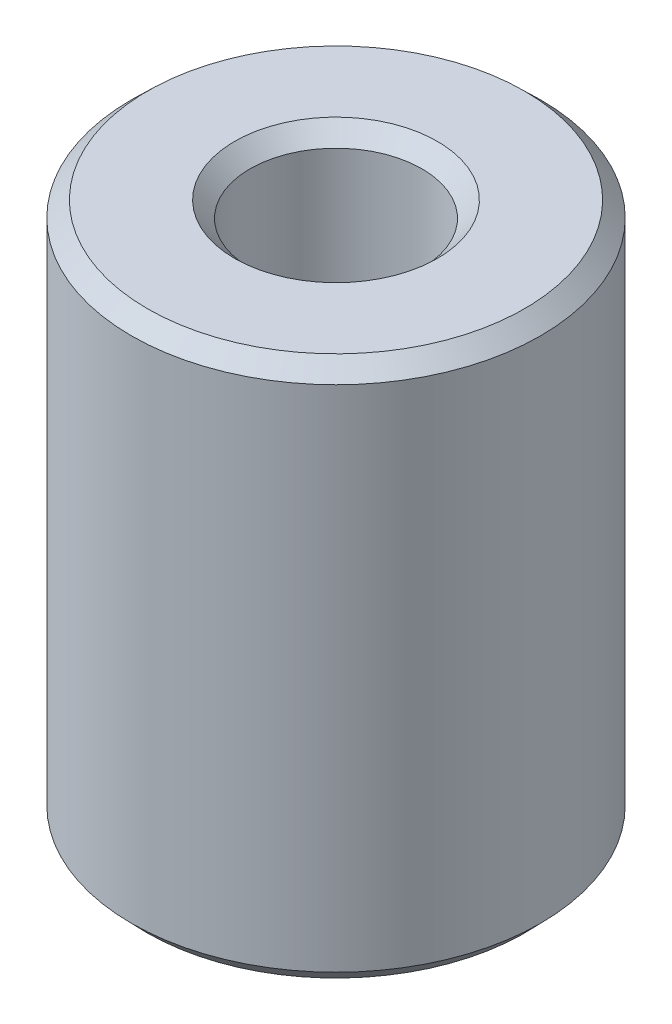
ISO-10303-21;
HEADER;
FILE_DESCRIPTION(('STEP AP214'),'2;1');
FILE_NAME('part.step','',(''),(''),'','','');
FILE_SCHEMA(('AUTOMOTIVE_DESIGN { 1 0 10303 214 1 1 1 1 }'));
ENDSEC;
DATA;
#1=APPLICATION_CONTEXT('core data for automotive mechanical design processes');
#2=APPLICATION_PROTOCOL_DEFINITION('international standard','automotive_design',2000,#1);
#3=PRODUCT_CONTEXT('',#1,'mechanical');
#4=PRODUCT('Part','Part','',(#3));
#5=PRODUCT_RELATED_PRODUCT_CATEGORY('part','',(#4));
#6=PRODUCT_DEFINITION_FORMATION('','',#4);
#7=PRODUCT_DEFINITION_CONTEXT('part definition',#1,'design');
#8=PRODUCT_DEFINITION('design','',#6,#7);
#9=PRODUCT_DEFINITION_SHAPE('','',#8);
#10=(LENGTH_UNIT() NAMED_UNIT(*) SI_UNIT(.MILLI.,.METRE.));
#11=(NAMED_UNIT(*) PLANE_ANGLE_UNIT() SI_UNIT($,.RADIAN.));
#12=(NAMED_UNIT(*) SI_UNIT($,.STERADIAN.) SOLID_ANGLE_UNIT());
#13=UNCERTAINTY_MEASURE_WITH_UNIT(LENGTH_MEASURE(1.E-05),#10,'distance_accuracy_value','');
#14=(GEOMETRIC_REPRESENTATION_CONTEXT(3) GLOBAL_UNCERTAINTY_ASSIGNED_CONTEXT((#13)) GLOBAL_UNIT_ASSIGNED_CONTEXT((#10,
#11,#12)) REPRESENTATION_CONTEXT('',''));
#15=CARTESIAN_POINT('',(0.,0.,0.));
#16=DIRECTION('',(0.,0.,1.));
#17=DIRECTION('',(1.,0.,0.));
#18=AXIS2_PLACEMENT_3D('',#15,#16,#17);
#19=CARTESIAN_POINT('',(0.,52.8330133797445,0.));
#20=DIRECTION('',(0.,-1.,0.));
#21=DIRECTION('',(0.,0.,-1.));
#22=AXIS2_PLACEMENT_3D('',#19,#20,#21);
#23=CYLINDRICAL_SURFACE('',#22,20.);
#24=CARTESIAN_POINT('',(0.,1.56288196948306,0.));
#25=DIRECTION('',(0.,1.,0.));
#26=DIRECTION('',(0.,0.,1.));
#27=AXIS2_PLACEMENT_3D('',#24,#25,#26);
#28=CIRCLE('',#27,20.);
#29=CARTESIAN_POINT('',(0.,1.56288196948305,-20.));
#30=VERTEX_POINT('',#29);
#31=EDGE_CURVE('E10',#30,#30,#28,.T.);
#32=CARTESIAN_POINT('',(0.,51.3187331504291,0.));
#33=DIRECTION('',(0.,1.,0.));
#34=DIRECTION('',(0.,0.,1.));
#35=AXIS2_PLACEMENT_3D('',#32,#33,#34);
#36=CIRCLE('',#35,20.);
#37=CARTESIAN_POINT('',(0.,51.3187331504291,-20.));
#38=VERTEX_POINT('',#37);
#39=EDGE_CURVE('E50',#38,#38,#36,.F.);
#40=CARTESIAN_POINT('',(0.,1.56288196948305,-20.));
#41=CARTESIAN_POINT('',(0.,2.08117208595124,-20.));
#42=CARTESIAN_POINT('',(0.,2.59946220241943,-20.));
#43=CARTESIAN_POINT('',(0.,3.6360424353558,-20.));
#44=CARTESIAN_POINT('',(0.,4.15433255182399,-20.));
#45=CARTESIAN_POINT('',(0.,5.19091278476037,-20.));
#46=CARTESIAN_POINT('',(0.,5.70920290122855,-20.));
#47=CARTESIAN_POINT('',(0.,6.74578313416493,-20.));
#48=CARTESIAN_POINT('',(0.,7.26407325063311,-20.));
#49=CARTESIAN_POINT('',(0.,8.30065348356949,-20.));
#50=CARTESIAN_POINT('',(0.,8.81894360003768,-20.));
#51=CARTESIAN_POINT('',(0.,9.85552383297406,-20.));
#52=CARTESIAN_POINT('',(0.,10.3738139494422,-20.));
#53=CARTESIAN_POINT('',(0.,11.4103941823786,-20.));
#54=CARTESIAN_POINT('',(0.,11.9286842988468,-20.));
#55=CARTESIAN_POINT('',(0.,12.9652645317832,-20.));
#56=CARTESIAN_POINT('',(0.,13.4835546482514,-20.));
#57=CARTESIAN_POINT('',(0.,14.5201348811877,-20.));
#58=CARTESIAN_POINT('',(0.,15.0384249976559,-20.));
#59=CARTESIAN_POINT('',(0.,16.0750052305923,-20.));
#60=CARTESIAN_POINT('',(0.,16.5932953470605,-20.));
#61=CARTESIAN_POINT('',(0.,17.6298755799969,-20.));
#62=CARTESIAN_POINT('',(0.,18.1481656964651,-20.));
#63=CARTESIAN_POINT('',(0.,19.1847459294014,-20.));
#64=CARTESIAN_POINT('',(0.,19.7030360458696,-20.));
#65=CARTESIAN_POINT('',(0.,20.739616278806,-20.));
#66=CARTESIAN_POINT('',(0.,21.2579063952742,-20.));
#67=CARTESIAN_POINT('',(0.,22.2944866282106,-20.));
#68=CARTESIAN_POINT('',(0.,22.8127767446787,-20.));
#69=CARTESIAN_POINT('',(0.,23.8493569776151,-20.));
#70=CARTESIAN_POINT('',(0.,24.3676470940833,-20.));
#71=CARTESIAN_POINT('',(0.,25.4042273270197,-20.));
#72=CARTESIAN_POINT('',(0.,25.9225174434879,-20.));
#73=CARTESIAN_POINT('',(0.,26.9590976764242,-20.));
#74=CARTESIAN_POINT('',(0.,27.4773877928924,-20.));
#75=CARTESIAN_POINT('',(0.,28.5139680258288,-20.));
#76=CARTESIAN_POINT('',(0.,29.032258142297,-20.));
#77=CARTESIAN_POINT('',(0.,30.0688383752334,-20.));
#78=CARTESIAN_POINT('',(0.,30.5871284917016,-20.));
#79=CARTESIAN_POINT('',(0.,31.6237087246379,-20.));
#80=CARTESIAN_POINT('',(0.,32.1419988411061,-20.));
#81=CARTESIAN_POINT('',(0.,33.1785790740425,-20.));
#82=CARTESIAN_POINT('',(0.,33.6968691905107,-20.));
#83=CARTESIAN_POINT('',(0.,34.7334494234471,-20.));
#84=CARTESIAN_POINT('',(0.,35.2517395399152,-20.));
#85=CARTESIAN_POINT('',(0.,36.2883197728516,-20.));
#86=CARTESIAN_POINT('',(0.,36.8066098893198,-20.));
#87=CARTESIAN_POINT('',(0.,37.8431901222562,-20.));
#88=CARTESIAN_POINT('',(0.,38.3614802387244,-20.));
#89=CARTESIAN_POINT('',(0.,39.3980604716607,-20.));
#90=CARTESIAN_POINT('',(0.,39.9163505881289,-20.));
#91=CARTESIAN_POINT('',(0.,40.9529308210653,-20.));
#92=CARTESIAN_POINT('',(0.,41.4712209375335,-20.));
#93=CARTESIAN_POINT('',(0.,42.5078011704699,-20.));
#94=CARTESIAN_POINT('',(0.,43.0260912869381,-20.));
#95=CARTESIAN_POINT('',(0.,44.0626715198744,-20.));
#96=CARTESIAN_POINT('',(0.,44.5809616363426,-20.));
#97=CARTESIAN_POINT('',(0.,45.617541869279,-20.));
#98=CARTESIAN_POINT('',(0.,46.1358319857472,-20.));
#99=CARTESIAN_POINT('',(0.,47.1724122186836,-20.));
#100=CARTESIAN_POINT('',(0.,47.6907023351517,-20.));
#101=CARTESIAN_POINT('',(0.,48.7272825680881,-20.));
#102=CARTESIAN_POINT('',(0.,49.2455726845563,-20.));
#103=CARTESIAN_POINT('',(0.,50.2821529174927,-20.));
#104=CARTESIAN_POINT('',(0.,50.8004430339609,-20.));
#105=CARTESIAN_POINT('',(0.,51.3187331504291,-20.));
#106=B_SPLINE_CURVE_WITH_KNOTS('',3,(#40,#41,#42,#43,#44,#45,#46,#47,#48,#49,#50,#51,#52,#53,
#54,#55,#56,#57,#58,#59,#60,#61,#62,#63,#64,#65,#66,#67,#68,#69,#70,#71,#72,#73,#74,#75,#76,#77,
#78,#79,#80,#81,#82,#83,#84,#85,#86,#87,#88,#89,#90,#91,#92,#93,#94,#95,#96,#97,#98,#99,#100,
#101,#102,#103,#104,#105),.UNSPECIFIED.,.F.,.F.,(4,2,2,2,2,2,2,2,2,2,2,2,2,2,2,2,2,2,2,2,2,2,2,
2,2,2,2,2,2,2,2,2,4),(0.,1.55487034940456,3.10974069880913,4.66461104821369,6.21948139761825,
7.77435174702282,9.32922209642738,10.8840924458319,12.4389627952365,13.9938331446411,
15.5487034940456,17.1035738434502,18.6584441928548,20.2133145422593,21.7681848916639,
23.3230552410684,24.877925590473,26.4327959398776,27.9876662892821,29.5425366386867,
31.0974069880913,32.6522773374958,34.2071476869004,35.7620180363049,37.3168883857095,
38.8717587351141,40.4266290845186,41.9814994339232,43.5363697833278,45.0912401327323,
46.6461104821369,48.2009808315414,49.755851180946),.UNSPECIFIED.);
#107=EDGE_CURVE('BSEAM39',#30,#38,#106,.T.);
#108=ORIENTED_EDGE('',*,*,#31,.T.);
#109=ORIENTED_EDGE('',*,*,#39,.T.);
#110=ORIENTED_EDGE('',*,*,#107,.T.);
#111=ORIENTED_EDGE('',*,*,#107,.F.);
#112=EDGE_LOOP('',(#108,#110,#109,#111));
#113=FACE_BOUND('',#112,.T.);
#114=ADVANCED_FACE('F39',(#113),#23,.T.);
#115=CARTESIAN_POINT('',(0.,52.8330133797445,0.));
#116=DIRECTION('',(0.,1.,0.));
#117=DIRECTION('',(0.,0.,1.));
#118=AXIS2_PLACEMENT_3D('',#115,#116,#117);
#119=PLANE('',#118);
#120=CARTESIAN_POINT('',(0.,52.8330133797445,0.));
#121=DIRECTION('',(0.,1.,0.));
#122=DIRECTION('',(0.,0.,1.));
#123=AXIS2_PLACEMENT_3D('',#120,#121,#122);
#124=CIRCLE('',#123,9.91834921758917);
#125=CARTESIAN_POINT('',(0.,52.8330133797445,9.91834921758917));
#126=VERTEX_POINT('',#125);
#127=EDGE_CURVE('E58',#126,#126,#124,.F.);
#128=ORIENTED_EDGE('',*,*,#127,.T.);
#129=EDGE_LOOP('',(#128));
#130=FACE_BOUND('',#129,.T.);
#131=CARTESIAN_POINT('',(0.,52.8330133797445,0.));
#132=DIRECTION('',(0.,1.,0.));
#133=DIRECTION('',(0.,0.,1.));
#134=AXIS2_PLACEMENT_3D('',#131,#132,#133);
#135=CIRCLE('',#134,18.437118030517);
#136=CARTESIAN_POINT('',(0.,52.8330133797445,18.437118030517));
#137=VERTEX_POINT('',#136);
#138=EDGE_CURVE('E61',#137,#137,#135,.T.);
#139=ORIENTED_EDGE('',*,*,#138,.T.);
#140=EDGE_LOOP('',(#139));
#141=FACE_BOUND('',#140,.T.);
#142=ADVANCED_FACE('F88',(#130,#141),#119,.T.);
#143=CARTESIAN_POINT('',(0.,0.,0.));
#144=DIRECTION('',(0.,1.,0.));
#145=DIRECTION('',(0.,0.,1.));
#146=AXIS2_PLACEMENT_3D('',#143,#144,#145);
#147=PLANE('',#146);
#148=CARTESIAN_POINT('',(0.,0.,0.));
#149=DIRECTION('',(0.,1.,0.));
#150=DIRECTION('',(0.,0.,1.));
#151=AXIS2_PLACEMENT_3D('',#148,#149,#150);
#152=CIRCLE('',#151,9.9669509577566);
#153=CARTESIAN_POINT('',(0.,0.,9.9669509577566));
#154=VERTEX_POINT('',#153);
#155=EDGE_CURVE('E51',#154,#154,#152,.T.);
#156=ORIENTED_EDGE('',*,*,#155,.T.);
#157=EDGE_LOOP('',(#156));
#158=FACE_BOUND('',#157,.T.);
#159=CARTESIAN_POINT('',(0.,0.,0.));
#160=DIRECTION('',(0.,1.,0.));
#161=DIRECTION('',(0.,0.,1.));
#162=AXIS2_PLACEMENT_3D('',#159,#160,#161);
#163=CIRCLE('',#162,18.4857197706844);
#164=CARTESIAN_POINT('',(0.,0.,18.4857197706844));
#165=VERTEX_POINT('',#164);
#166=EDGE_CURVE('E54',#165,#165,#163,.F.);
#167=ORIENTED_EDGE('',*,*,#166,.T.);
#168=EDGE_LOOP('',(#167));
#169=FACE_BOUND('',#168,.T.);
#170=ADVANCED_FACE('F83',(#158,#169),#147,.F.);
#171=CARTESIAN_POINT('',(0.,52.8330133797445,0.));
#172=DIRECTION('',(0.,-1.,0.));
#173=DIRECTION('',(0.,0.,-1.));
#174=AXIS2_PLACEMENT_3D('',#171,#172,#173);
#175=CYLINDRICAL_SURFACE('',#174,8.40406898827362);
#176=CARTESIAN_POINT('',(0.,51.2701314102615,0.));
#177=DIRECTION('',(0.,1.,0.));
#178=DIRECTION('',(0.,0.,1.));
#179=AXIS2_PLACEMENT_3D('',#176,#177,#178);
#180=CIRCLE('',#179,8.40406898827362);
#181=CARTESIAN_POINT('',(0.,51.2701314102615,-8.40406898827362));
#182=VERTEX_POINT('',#181);
#183=EDGE_CURVE('E67',#182,#182,#180,.T.);
#184=CARTESIAN_POINT('',(0.,1.51428022931549,0.));
#185=DIRECTION('',(0.,1.,0.));
#186=DIRECTION('',(0.,0.,1.));
#187=AXIS2_PLACEMENT_3D('',#184,#185,#186);
#188=CIRCLE('',#187,8.40406898827362);
#189=CARTESIAN_POINT('',(0.,1.51428022931549,-8.40406898827362));
#190=VERTEX_POINT('',#189);
#191=EDGE_CURVE('E69',#190,#190,#188,.F.);
#192=CARTESIAN_POINT('',(0.,51.2701314102615,-8.40406898827362));
#193=CARTESIAN_POINT('',(0.,50.7518412937933,-8.40406898827362));
#194=CARTESIAN_POINT('',(0.,50.2335511773251,-8.40406898827362));
#195=CARTESIAN_POINT('',(0.,49.1969709443887,-8.40406898827362));
#196=CARTESIAN_POINT('',(0.,48.6786808279205,-8.40406898827362));
#197=CARTESIAN_POINT('',(0.,47.6421005949842,-8.40406898827362));
#198=CARTESIAN_POINT('',(0.,47.123810478516,-8.40406898827362));
#199=CARTESIAN_POINT('',(0.,46.0872302455796,-8.40406898827362));
#200=CARTESIAN_POINT('',(0.,45.5689401291114,-8.40406898827362));
#201=CARTESIAN_POINT('',(0.,44.532359896175,-8.40406898827362));
#202=CARTESIAN_POINT('',(0.,44.0140697797069,-8.40406898827362));
#203=CARTESIAN_POINT('',(0.,42.9774895467705,-8.40406898827362));
#204=CARTESIAN_POINT('',(0.,42.4591994303023,-8.40406898827362));
#205=CARTESIAN_POINT('',(0.,41.4226191973659,-8.40406898827362));
#206=CARTESIAN_POINT('',(0.,40.9043290808977,-8.40406898827362));
#207=CARTESIAN_POINT('',(0.,39.8677488479614,-8.40406898827362));
#208=CARTESIAN_POINT('',(0.,39.3494587314932,-8.40406898827362));
#209=CARTESIAN_POINT('',(0.,38.3128784985568,-8.40406898827362));
#210=CARTESIAN_POINT('',(0.,37.7945883820886,-8.40406898827362));
#211=CARTESIAN_POINT('',(0.,36.7580081491522,-8.40406898827362));
#212=CARTESIAN_POINT('',(0.,36.239718032684,-8.40406898827362));
#213=CARTESIAN_POINT('',(0.,35.2031377997477,-8.40406898827362));
#214=CARTESIAN_POINT('',(0.,34.6848476832795,-8.40406898827362));
#215=CARTESIAN_POINT('',(0.,33.6482674503431,-8.40406898827362));
#216=CARTESIAN_POINT('',(0.,33.1299773338749,-8.40406898827362));
#217=CARTESIAN_POINT('',(0.,32.0933971009385,-8.40406898827362));
#218=CARTESIAN_POINT('',(0.,31.5751069844704,-8.40406898827362));
#219=CARTESIAN_POINT('',(0.,30.538526751534,-8.40406898827362));
#220=CARTESIAN_POINT('',(0.,30.0202366350658,-8.40406898827362));
#221=CARTESIAN_POINT('',(0.,28.9836564021294,-8.40406898827362));
#222=CARTESIAN_POINT('',(0.,28.4653662856612,-8.40406898827362));
#223=CARTESIAN_POINT('',(0.,27.4287860527249,-8.40406898827362));
#224=CARTESIAN_POINT('',(0.,26.9104959362567,-8.40406898827362));
#225=CARTESIAN_POINT('',(0.,25.8739157033203,-8.40406898827362));
#226=CARTESIAN_POINT('',(0.,25.3556255868521,-8.40406898827362));
#227=CARTESIAN_POINT('',(0.,24.3190453539157,-8.40406898827362));
#228=CARTESIAN_POINT('',(0.,23.8007552374475,-8.40406898827362));
#229=CARTESIAN_POINT('',(0.,22.7641750045112,-8.40406898827362));
#230=CARTESIAN_POINT('',(0.,22.245884888043,-8.40406898827362));
#231=CARTESIAN_POINT('',(0.,21.2093046551066,-8.40406898827362));
#232=CARTESIAN_POINT('',(0.,20.6910145386384,-8.40406898827362));
#233=CARTESIAN_POINT('',(0.,19.654434305702,-8.40406898827362));
#234=CARTESIAN_POINT('',(0.,19.1361441892339,-8.40406898827362));
#235=CARTESIAN_POINT('',(0.,18.0995639562975,-8.40406898827362));
#236=CARTESIAN_POINT('',(0.,17.5812738398293,-8.40406898827362));
#237=CARTESIAN_POINT('',(0.,16.5446936068929,-8.40406898827362));
#238=CARTESIAN_POINT('',(0.,16.0264034904247,-8.40406898827362));
#239=CARTESIAN_POINT('',(0.,14.9898232574884,-8.40406898827362));
#240=CARTESIAN_POINT('',(0.,14.4715331410202,-8.40406898827362));
#241=CARTESIAN_POINT('',(0.,13.4349529080838,-8.40406898827362));
#242=CARTESIAN_POINT('',(0.,12.9166627916156,-8.40406898827362));
#243=CARTESIAN_POINT('',(0.,11.8800825586792,-8.40406898827362));
#244=CARTESIAN_POINT('',(0.,11.361792442211,-8.40406898827362));
#245=CARTESIAN_POINT('',(0.,10.3252122092747,-8.40406898827362));
#246=CARTESIAN_POINT('',(0.,9.80692209280649,-8.40406898827362));
#247=CARTESIAN_POINT('',(0.,8.77034185987011,-8.40406898827362));
#248=CARTESIAN_POINT('',(0.,8.25205174340193,-8.40406898827362));
#249=CARTESIAN_POINT('',(0.,7.21547151046555,-8.40406898827362));
#250=CARTESIAN_POINT('',(0.,6.69718139399737,-8.40406898827362));
#251=CARTESIAN_POINT('',(0.,5.66060116106099,-8.40406898827362));
#252=CARTESIAN_POINT('',(0.,5.1423110445928,-8.40406898827362));
#253=CARTESIAN_POINT('',(0.,4.10573081165642,-8.40406898827362));
#254=CARTESIAN_POINT('',(0.,3.58744069518824,-8.40406898827362));
#255=CARTESIAN_POINT('',(0.,2.55086046225186,-8.40406898827362));
#256=CARTESIAN_POINT('',(0.,2.03257034578368,-8.40406898827362));
#257=CARTESIAN_POINT('',(0.,1.51428022931549,-8.40406898827362));
#258=B_SPLINE_CURVE_WITH_KNOTS('',3,(#192,#193,#194,#195,#196,#197,#198,#199,#200,#201,#202,
#203,#204,#205,#206,#207,#208,#209,#210,#211,#212,#213,#214,#215,#216,#217,#218,#219,#220,#221,
#222,#223,#224,#225,#226,#227,#228,#229,#230,#231,#232,#233,#234,#235,#236,#237,#238,#239,#240,
#241,#242,#243,#244,#245,#246,#247,#248,#249,#250,#251,#252,#253,#254,#255,#256,#257),
.UNSPECIFIED.,.F.,.F.,(4,2,2,2,2,2,2,2,2,2,2,2,2,2,2,2,2,2,2,2,2,2,2,2,2,2,2,2,2,2,2,2,4),(0.,
1.55487034940456,3.10974069880912,4.66461104821368,6.21948139761824,7.7743517470228,
9.32922209642736,10.8840924458319,12.4389627952365,13.9938331446411,15.5487034940456,
17.1035738434502,18.6584441928547,20.2133145422593,21.7681848916639,23.3230552410684,
24.877925590473,26.4327959398775,27.9876662892821,29.5425366386867,31.0974069880912,
32.6522773374958,34.2071476869004,35.7620180363049,37.3168883857095,38.871758735114,
40.4266290845186,41.9814994339232,43.5363697833277,45.0912401327323,46.6461104821369,
48.2009808315414,49.755851180946),.UNSPECIFIED.);
#259=EDGE_CURVE('BSEAM71',#182,#190,#258,.T.);
#260=ORIENTED_EDGE('',*,*,#183,.T.);
#261=ORIENTED_EDGE('',*,*,#191,.T.);
#262=ORIENTED_EDGE('',*,*,#259,.T.);
#263=ORIENTED_EDGE('',*,*,#259,.F.);
#264=EDGE_LOOP('',(#260,#262,#261,#263));
#265=FACE_BOUND('',#264,.T.);
#266=ADVANCED_FACE('F71',(#265),#175,.F.);
#267=CARTESIAN_POINT('',(0.,51.2701314102615,0.));
#268=DIRECTION('',(0.,1.,0.));
#269=DIRECTION('',(0.,0.,1.));
#270=AXIS2_PLACEMENT_3D('',#267,#268,#269);
#271=CONICAL_SURFACE('',#270,8.40406898827362,0.769605138455023);
#272=ORIENTED_EDGE('',*,*,#127,.F.);
#273=EDGE_LOOP('',(#272));
#274=FACE_BOUND('',#273,.T.);
#275=ORIENTED_EDGE('',*,*,#183,.F.);
#276=EDGE_LOOP('',(#275));
#277=FACE_BOUND('',#276,.T.);
#278=ADVANCED_FACE('F77',(#274,#277),#271,.F.);
#279=CARTESIAN_POINT('',(0.,0.,0.));
#280=DIRECTION('',(0.,-1.,0.));
#281=DIRECTION('',(0.,0.,-1.));
#282=AXIS2_PLACEMENT_3D('',#279,#280,#281);
#283=CONICAL_SURFACE('',#282,9.9669509577566,0.801191188339871);
#284=ORIENTED_EDGE('',*,*,#191,.F.);
#285=EDGE_LOOP('',(#284));
#286=FACE_BOUND('',#285,.T.);
#287=ORIENTED_EDGE('',*,*,#155,.F.);
#288=EDGE_LOOP('',(#287));
#289=FACE_BOUND('',#288,.T.);
#290=ADVANCED_FACE('F73',(#286,#289),#283,.F.);
#291=CARTESIAN_POINT('',(0.,1.56288196948306,0.));
#292=DIRECTION('',(0.,1.,0.));
#293=DIRECTION('',(0.,0.,1.));
#294=AXIS2_PLACEMENT_3D('',#291,#292,#293);
#295=CONICAL_SURFACE('',#294,20.,0.769605138455021);
#296=ORIENTED_EDGE('',*,*,#166,.F.);
#297=EDGE_LOOP('',(#296));
#298=FACE_BOUND('',#297,.T.);
#299=ORIENTED_EDGE('',*,*,#31,.F.);
#300=EDGE_LOOP('',(#299));
#301=FACE_BOUND('',#300,.T.);
#302=ADVANCED_FACE('F76',(#298,#301),#295,.T.);
#303=CARTESIAN_POINT('',(0.,52.8330133797445,0.));
#304=DIRECTION('',(0.,-1.,0.));
#305=DIRECTION('',(0.,0.,-1.));
#306=AXIS2_PLACEMENT_3D('',#303,#304,#305);
#307=CONICAL_SURFACE('',#306,18.437118030517,0.801191188339872);
#308=ORIENTED_EDGE('',*,*,#39,.F.);
#309=EDGE_LOOP('',(#308));
#310=FACE_BOUND('',#309,.T.);
#311=ORIENTED_EDGE('',*,*,#138,.F.);
#312=EDGE_LOOP('',(#311));
#313=FACE_BOUND('',#312,.T.);
#314=ADVANCED_FACE('F45',(#310,#313),#307,.T.);
#315=CLOSED_SHELL('',(#114,#142,#170,#266,#278,#290,#302,#314));
#316=MANIFOLD_SOLID_BREP('B2',#315);
#317=ADVANCED_BREP_SHAPE_REPRESENTATION('',(#18,#316),#14);
#318=SHAPE_DEFINITION_REPRESENTATION(#9,#317);
ENDSEC;
END-ISO-10303-21;
